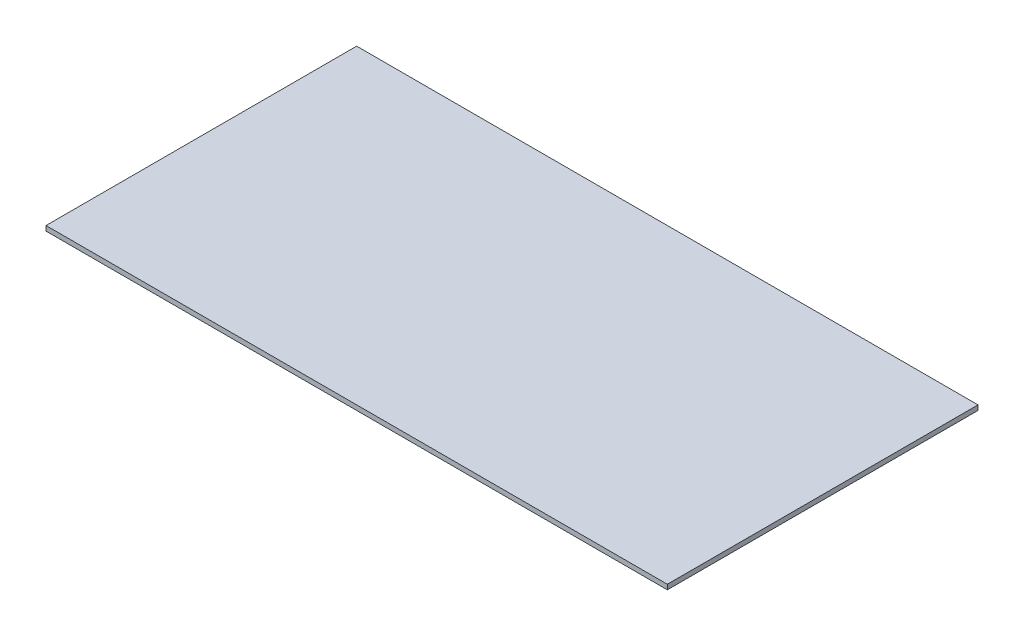
ISO-10303-21;
HEADER;
FILE_DESCRIPTION(('STEP AP214'),'2;1');
FILE_NAME('part.step','',(''),(''),'','','');
FILE_SCHEMA(('AUTOMOTIVE_DESIGN { 1 0 10303 214 1 1 1 1 }'));
ENDSEC;
DATA;
#1=APPLICATION_CONTEXT('core data for automotive mechanical design processes');
#2=APPLICATION_PROTOCOL_DEFINITION('international standard','automotive_design',2000,#1);
#3=PRODUCT_CONTEXT('',#1,'mechanical');
#4=PRODUCT('Part','Part','',(#3));
#5=PRODUCT_RELATED_PRODUCT_CATEGORY('part','',(#4));
#6=PRODUCT_DEFINITION_FORMATION('','',#4);
#7=PRODUCT_DEFINITION_CONTEXT('part definition',#1,'design');
#8=PRODUCT_DEFINITION('design','',#6,#7);
#9=PRODUCT_DEFINITION_SHAPE('','',#8);
#10=(LENGTH_UNIT() NAMED_UNIT(*) SI_UNIT(.MILLI.,.METRE.));
#11=(NAMED_UNIT(*) PLANE_ANGLE_UNIT() SI_UNIT($,.RADIAN.));
#12=(NAMED_UNIT(*) SI_UNIT($,.STERADIAN.) SOLID_ANGLE_UNIT());
#13=UNCERTAINTY_MEASURE_WITH_UNIT(LENGTH_MEASURE(1.E-05),#10,'distance_accuracy_value','');
#14=(GEOMETRIC_REPRESENTATION_CONTEXT(3) GLOBAL_UNCERTAINTY_ASSIGNED_CONTEXT((#13)) GLOBAL_UNIT_ASSIGNED_CONTEXT((#10,
#11,#12)) REPRESENTATION_CONTEXT('',''));
#15=CARTESIAN_POINT('',(0.,0.,0.));
#16=DIRECTION('',(0.,0.,1.));
#17=DIRECTION('',(1.,0.,0.));
#18=AXIS2_PLACEMENT_3D('',#15,#16,#17);
#19=CARTESIAN_POINT('',(0.,3.175,0.));
#20=DIRECTION('',(0.,1.,0.));
#21=DIRECTION('',(0.,0.,1.));
#22=AXIS2_PLACEMENT_3D('',#19,#20,#21);
#23=PLANE('',#22);
#24=DIRECTION('',(-1.,0.,0.));
#25=VECTOR('',#24,1.);
#26=CARTESIAN_POINT('',(203.2,3.175,-101.6));
#27=LINE('',#26,#25);
#28=CARTESIAN_POINT('',(-203.2,3.175,-101.6));
#29=VERTEX_POINT('',#28);
#30=CARTESIAN_POINT('',(203.2,3.175,-101.6));
#31=VERTEX_POINT('',#30);
#32=EDGE_CURVE('E67',#29,#31,#27,.F.);
#33=ORIENTED_EDGE('',*,*,#32,.F.);
#34=DIRECTION('',(0.,0.,1.));
#35=VECTOR('',#34,1.);
#36=CARTESIAN_POINT('',(-203.2,3.175,-101.6));
#37=LINE('',#36,#35);
#38=CARTESIAN_POINT('',(-203.2,3.175,101.6));
#39=VERTEX_POINT('',#38);
#40=EDGE_CURVE('E19',#39,#29,#37,.F.);
#41=ORIENTED_EDGE('',*,*,#40,.F.);
#42=DIRECTION('',(1.,0.,0.));
#43=VECTOR('',#42,1.);
#44=CARTESIAN_POINT('',(-203.2,3.175,101.6));
#45=LINE('',#44,#43);
#46=CARTESIAN_POINT('',(203.2,3.175,101.6));
#47=VERTEX_POINT('',#46);
#48=EDGE_CURVE('E57',#47,#39,#45,.F.);
#49=ORIENTED_EDGE('',*,*,#48,.F.);
#50=DIRECTION('',(0.,0.,-1.));
#51=VECTOR('',#50,1.);
#52=CARTESIAN_POINT('',(203.2,3.175,101.6));
#53=LINE('',#52,#51);
#54=EDGE_CURVE('E52',#31,#47,#53,.F.);
#55=ORIENTED_EDGE('',*,*,#54,.F.);
#56=EDGE_LOOP('',(#33,#41,#49,#55));
#57=FACE_BOUND('',#56,.T.);
#58=ADVANCED_FACE('F16',(#57),#23,.T.);
#59=CARTESIAN_POINT('',(-203.2,0.,-101.6));
#60=DIRECTION('',(-1.,0.,0.));
#61=DIRECTION('',(0.,0.,1.));
#62=AXIS2_PLACEMENT_3D('',#59,#60,#61);
#63=PLANE('',#62);
#64=DIRECTION('',(0.,1.,0.));
#65=VECTOR('',#64,1.);
#66=CARTESIAN_POINT('',(-203.2,0.,-101.6));
#67=LINE('',#66,#65);
#68=CARTESIAN_POINT('',(-203.2,0.,-101.6));
#69=VERTEX_POINT('',#68);
#70=EDGE_CURVE('E78',#69,#29,#67,.T.);
#71=ORIENTED_EDGE('',*,*,#70,.F.);
#72=DIRECTION('',(0.,0.,1.));
#73=VECTOR('',#72,1.);
#74=CARTESIAN_POINT('',(-203.2,0.,0.));
#75=LINE('',#74,#73);
#76=CARTESIAN_POINT('',(-203.2,0.,101.6));
#77=VERTEX_POINT('',#76);
#78=EDGE_CURVE('E73',#69,#77,#75,.T.);
#79=ORIENTED_EDGE('',*,*,#78,.T.);
#80=DIRECTION('',(0.,1.,0.));
#81=VECTOR('',#80,1.);
#82=CARTESIAN_POINT('',(-203.2,0.,101.6));
#83=LINE('',#82,#81);
#84=EDGE_CURVE('E62',#39,#77,#83,.F.);
#85=ORIENTED_EDGE('',*,*,#84,.F.);
#86=ORIENTED_EDGE('',*,*,#40,.T.);
#87=EDGE_LOOP('',(#71,#79,#85,#86));
#88=FACE_BOUND('',#87,.T.);
#89=ADVANCED_FACE('F72',(#88),#63,.T.);
#90=CARTESIAN_POINT('',(-203.2,0.,101.6));
#91=DIRECTION('',(0.,0.,1.));
#92=DIRECTION('',(1.,0.,0.));
#93=AXIS2_PLACEMENT_3D('',#90,#91,#92);
#94=PLANE('',#93);
#95=ORIENTED_EDGE('',*,*,#84,.T.);
#96=DIRECTION('',(1.,0.,0.));
#97=VECTOR('',#96,1.);
#98=CARTESIAN_POINT('',(0.,0.,101.6));
#99=LINE('',#98,#97);
#100=CARTESIAN_POINT('',(203.2,0.,101.6));
#101=VERTEX_POINT('',#100);
#102=EDGE_CURVE('E83',#77,#101,#99,.T.);
#103=ORIENTED_EDGE('',*,*,#102,.T.);
#104=DIRECTION('',(0.,1.,0.));
#105=VECTOR('',#104,1.);
#106=CARTESIAN_POINT('',(203.2,0.,101.6));
#107=LINE('',#106,#105);
#108=EDGE_CURVE('E64',#47,#101,#107,.F.);
#109=ORIENTED_EDGE('',*,*,#108,.F.);
#110=ORIENTED_EDGE('',*,*,#48,.T.);
#111=EDGE_LOOP('',(#95,#103,#109,#110));
#112=FACE_BOUND('',#111,.T.);
#113=ADVANCED_FACE('F59',(#112),#94,.T.);
#114=CARTESIAN_POINT('',(203.2,0.,101.6));
#115=DIRECTION('',(1.,0.,0.));
#116=DIRECTION('',(0.,0.,-1.));
#117=AXIS2_PLACEMENT_3D('',#114,#115,#116);
#118=PLANE('',#117);
#119=ORIENTED_EDGE('',*,*,#108,.T.);
#120=DIRECTION('',(0.,0.,1.));
#121=VECTOR('',#120,1.);
#122=CARTESIAN_POINT('',(203.2,0.,0.));
#123=LINE('',#122,#121);
#124=CARTESIAN_POINT('',(203.2,0.,-101.6));
#125=VERTEX_POINT('',#124);
#126=EDGE_CURVE('E25',#101,#125,#123,.F.);
#127=ORIENTED_EDGE('',*,*,#126,.T.);
#128=DIRECTION('',(0.,1.,0.));
#129=VECTOR('',#128,1.);
#130=CARTESIAN_POINT('',(203.2,0.,-101.6));
#131=LINE('',#130,#129);
#132=EDGE_CURVE('E33',#31,#125,#131,.F.);
#133=ORIENTED_EDGE('',*,*,#132,.F.);
#134=ORIENTED_EDGE('',*,*,#54,.T.);
#135=EDGE_LOOP('',(#119,#127,#133,#134));
#136=FACE_BOUND('',#135,.T.);
#137=ADVANCED_FACE('F87',(#136),#118,.T.);
#138=CARTESIAN_POINT('',(203.2,0.,-101.6));
#139=DIRECTION('',(0.,0.,-1.));
#140=DIRECTION('',(-1.,0.,0.));
#141=AXIS2_PLACEMENT_3D('',#138,#139,#140);
#142=PLANE('',#141);
#143=ORIENTED_EDGE('',*,*,#132,.T.);
#144=DIRECTION('',(1.,0.,0.));
#145=VECTOR('',#144,1.);
#146=CARTESIAN_POINT('',(0.,0.,-101.6));
#147=LINE('',#146,#145);
#148=EDGE_CURVE('E11',#125,#69,#147,.F.);
#149=ORIENTED_EDGE('',*,*,#148,.T.);
#150=ORIENTED_EDGE('',*,*,#70,.T.);
#151=ORIENTED_EDGE('',*,*,#32,.T.);
#152=EDGE_LOOP('',(#143,#149,#150,#151));
#153=FACE_BOUND('',#152,.T.);
#154=ADVANCED_FACE('F90',(#153),#142,.T.);
#155=CARTESIAN_POINT('',(0.,0.,0.));
#156=DIRECTION('',(0.,1.,0.));
#157=DIRECTION('',(0.,0.,1.));
#158=AXIS2_PLACEMENT_3D('',#155,#156,#157);
#159=PLANE('',#158);
#160=ORIENTED_EDGE('',*,*,#126,.F.);
#161=ORIENTED_EDGE('',*,*,#102,.F.);
#162=ORIENTED_EDGE('',*,*,#78,.F.);
#163=ORIENTED_EDGE('',*,*,#148,.F.);
#164=EDGE_LOOP('',(#160,#161,#162,#163));
#165=FACE_BOUND('',#164,.T.);
#166=ADVANCED_FACE('F89',(#165),#159,.F.);
#167=CLOSED_SHELL('',(#58,#89,#113,#137,#154,#166));
#168=MANIFOLD_SOLID_BREP('B1',#167);
#169=ADVANCED_BREP_SHAPE_REPRESENTATION('',(#18,#168),#14);
#170=SHAPE_DEFINITION_REPRESENTATION(#9,#169);
ENDSEC;
END-ISO-10303-21;
